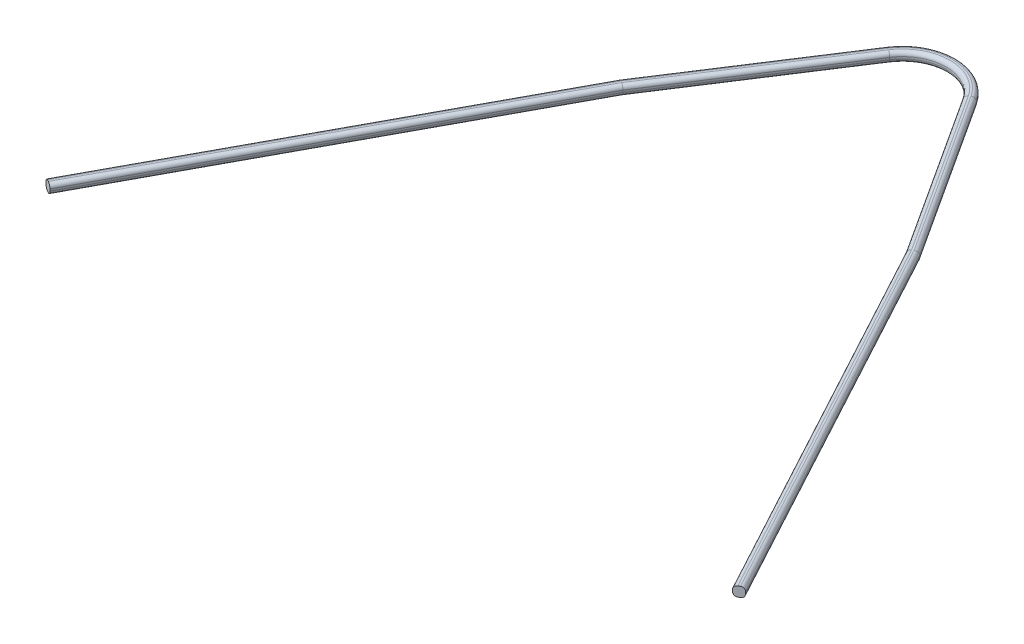
ISO-10303-21;
HEADER;
FILE_DESCRIPTION(('STEP AP214'),'2;1');
FILE_NAME('part.step','',(''),(''),'','','');
FILE_SCHEMA(('AUTOMOTIVE_DESIGN { 1 0 10303 214 1 1 1 1 }'));
ENDSEC;
DATA;
#1=APPLICATION_CONTEXT('core data for automotive mechanical design processes');
#2=APPLICATION_PROTOCOL_DEFINITION('international standard','automotive_design',2000,#1);
#3=PRODUCT_CONTEXT('',#1,'mechanical');
#4=PRODUCT('Part','Part','',(#3));
#5=PRODUCT_RELATED_PRODUCT_CATEGORY('part','',(#4));
#6=PRODUCT_DEFINITION_FORMATION('','',#4);
#7=PRODUCT_DEFINITION_CONTEXT('part definition',#1,'design');
#8=PRODUCT_DEFINITION('design','',#6,#7);
#9=PRODUCT_DEFINITION_SHAPE('','',#8);
#10=(LENGTH_UNIT() NAMED_UNIT(*) SI_UNIT(.MILLI.,.METRE.));
#11=(NAMED_UNIT(*) PLANE_ANGLE_UNIT() SI_UNIT($,.RADIAN.));
#12=(NAMED_UNIT(*) SI_UNIT($,.STERADIAN.) SOLID_ANGLE_UNIT());
#13=UNCERTAINTY_MEASURE_WITH_UNIT(LENGTH_MEASURE(1.E-05),#10,'distance_accuracy_value','');
#14=(GEOMETRIC_REPRESENTATION_CONTEXT(3) GLOBAL_UNCERTAINTY_ASSIGNED_CONTEXT((#13)) GLOBAL_UNIT_ASSIGNED_CONTEXT((#10,
#11,#12)) REPRESENTATION_CONTEXT('',''));
#15=CARTESIAN_POINT('',(0.,0.,0.));
#16=DIRECTION('',(0.,0.,1.));
#17=DIRECTION('',(1.,0.,0.));
#18=AXIS2_PLACEMENT_3D('',#15,#16,#17);
#19=CARTESIAN_POINT('',(-30.9052646215487,-1.,-33.9334810084748));
#20=DIRECTION('',(-0.879910803740285,0.,-0.475138903333673));
#21=DIRECTION('',(-0.475138903333673,0.,0.879910803740285));
#22=AXIS2_PLACEMENT_3D('',#19,#20,#21);
#23=PLANE('',#22);
#24=DIRECTION('',(0.,1.,0.));
#25=VECTOR('',#24,1.);
#26=CARTESIAN_POINT('',(-30.886104128777,-1.,-33.9689643681335));
#27=LINE('',#26,#25);
#28=CARTESIAN_POINT('',(-30.886104128777,-0.2,-33.9689643681335));
#29=VERTEX_POINT('',#28);
#30=CARTESIAN_POINT('',(-30.886104128777,0.2,-33.9689643681335));
#31=VERTEX_POINT('',#30);
#32=EDGE_CURVE('E340',#29,#31,#27,.T.);
#33=ORIENTED_EDGE('',*,*,#32,.F.);
#34=DIRECTION('',(-0.475138903333673,0.,0.879910803740285));
#35=VECTOR('',#34,1.);
#36=CARTESIAN_POINT('',(-72.303144154312,-0.2,42.7313452081154));
#37=LINE('',#36,#35);
#38=CARTESIAN_POINT('',(-72.303144154312,-0.2,42.7313452081154));
#39=VERTEX_POINT('',#38);
#40=EDGE_CURVE('E250',#29,#39,#37,.T.);
#41=ORIENTED_EDGE('',*,*,#40,.T.);
#42=DIRECTION('',(0.,1.,0.));
#43=VECTOR('',#42,1.);
#44=CARTESIAN_POINT('',(-72.303144154312,-1.,42.7313452081154));
#45=LINE('',#44,#43);
#46=CARTESIAN_POINT('',(-72.303144154312,0.2,42.7313452081154));
#47=VERTEX_POINT('',#46);
#48=EDGE_CURVE('E217',#39,#47,#45,.T.);
#49=ORIENTED_EDGE('',*,*,#48,.T.);
#50=DIRECTION('',(-0.475138903333673,0.,0.879910803740285));
#51=VECTOR('',#50,1.);
#52=CARTESIAN_POINT('',(-30.9052646215487,0.2,-33.9334810084748));
#53=LINE('',#52,#51);
#54=EDGE_CURVE('E248',#47,#31,#53,.F.);
#55=ORIENTED_EDGE('',*,*,#54,.T.);
#56=EDGE_LOOP('',(#33,#41,#49,#55));
#57=FACE_BOUND('',#56,.T.);
#58=ADVANCED_FACE('F34',(#57),#23,.T.);
#59=CARTESIAN_POINT('',(-9.2267435760683,-1.,-67.3381283920227));
#60=DIRECTION('',(-0.838794870551663,0.,-0.544447577950549));
#61=DIRECTION('',(-0.544447577950549,0.,0.838794870551663));
#62=AXIS2_PLACEMENT_3D('',#59,#60,#61);
#63=PLANE('',#62);
#64=DIRECTION('',(0.,1.,0.));
#65=VECTOR('',#64,1.);
#66=CARTESIAN_POINT('',(-9.2267435760683,-1.,-67.3381283920227));
#67=LINE('',#66,#65);
#68=CARTESIAN_POINT('',(-9.2267435760683,-0.2,-67.3381283920227));
#69=VERTEX_POINT('',#68);
#70=CARTESIAN_POINT('',(-9.2267435760683,0.2,-67.3381283920227));
#71=VERTEX_POINT('',#70);
#72=EDGE_CURVE('E473',#69,#71,#67,.T.);
#73=ORIENTED_EDGE('',*,*,#72,.F.);
#74=DIRECTION('',(-0.544447577950549,0.,0.838794870551663));
#75=VECTOR('',#74,1.);
#76=CARTESIAN_POINT('',(-30.886104128777,-0.2,-33.9689643681335));
#77=LINE('',#76,#75);
#78=EDGE_CURVE('E388',#69,#29,#77,.T.);
#79=ORIENTED_EDGE('',*,*,#78,.T.);
#80=ORIENTED_EDGE('',*,*,#32,.T.);
#81=DIRECTION('',(-0.544447577950549,0.,0.838794870551663));
#82=VECTOR('',#81,1.);
#83=CARTESIAN_POINT('',(-9.2267435760683,0.2,-67.3381283920227));
#84=LINE('',#83,#82);
#85=EDGE_CURVE('E386',#31,#71,#84,.F.);
#86=ORIENTED_EDGE('',*,*,#85,.T.);
#87=EDGE_LOOP('',(#73,#79,#80,#86));
#88=FACE_BOUND('',#87,.T.);
#89=ADVANCED_FACE('F497',(#88),#63,.T.);
#90=CARTESIAN_POINT('',(0.,-1.,-61.3492050345666));
#91=DIRECTION('',(0.,1.,0.));
#92=DIRECTION('',(0.,0.,1.));
#93=AXIS2_PLACEMENT_3D('',#90,#91,#92);
#94=CYLINDRICAL_SURFACE('',#93,11.);
#95=DIRECTION('',(0.,1.,0.));
#96=VECTOR('',#95,1.);
#97=CARTESIAN_POINT('',(9.22674357606829,-1.,-67.3381283920227));
#98=LINE('',#97,#96);
#99=CARTESIAN_POINT('',(9.22674357606829,-0.2,-67.3381283920227));
#100=VERTEX_POINT('',#99);
#101=CARTESIAN_POINT('',(9.22674357606829,0.2,-67.3381283920227));
#102=VERTEX_POINT('',#101);
#103=EDGE_CURVE('E317',#100,#102,#98,.T.);
#104=ORIENTED_EDGE('',*,*,#103,.F.);
#105=CARTESIAN_POINT('',(0.,-0.2,-61.3492050345666));
#106=DIRECTION('',(0.,1.,0.));
#107=DIRECTION('',(0.,0.,1.));
#108=AXIS2_PLACEMENT_3D('',#105,#106,#107);
#109=CIRCLE('',#108,11.);
#110=EDGE_CURVE('E393',#100,#69,#109,.T.);
#111=ORIENTED_EDGE('',*,*,#110,.T.);
#112=ORIENTED_EDGE('',*,*,#72,.T.);
#113=CARTESIAN_POINT('',(0.,0.2,-61.3492050345666));
#114=DIRECTION('',(0.,1.,0.));
#115=DIRECTION('',(0.,0.,1.));
#116=AXIS2_PLACEMENT_3D('',#113,#114,#115);
#117=CIRCLE('',#116,11.);
#118=EDGE_CURVE('E391',#71,#102,#117,.F.);
#119=ORIENTED_EDGE('',*,*,#118,.T.);
#120=EDGE_LOOP('',(#104,#111,#112,#119));
#121=FACE_BOUND('',#120,.T.);
#122=ADVANCED_FACE('F480',(#121),#94,.T.);
#123=CARTESIAN_POINT('',(9.22674357606829,-1.,-67.3381283920227));
#124=DIRECTION('',(0.838794870551663,0.,-0.544447577950549));
#125=DIRECTION('',(-0.544447577950549,0.,-0.838794870551663));
#126=AXIS2_PLACEMENT_3D('',#123,#124,#125);
#127=PLANE('',#126);
#128=DIRECTION('',(0.,1.,0.));
#129=VECTOR('',#128,1.);
#130=CARTESIAN_POINT('',(30.8861041287769,-1.,-33.9689643681335));
#131=LINE('',#130,#129);
#132=CARTESIAN_POINT('',(30.8861041287769,-0.2,-33.9689643681335));
#133=VERTEX_POINT('',#132);
#134=CARTESIAN_POINT('',(30.8861041287769,0.2,-33.9689643681335));
#135=VERTEX_POINT('',#134);
#136=EDGE_CURVE('E312',#133,#135,#131,.T.);
#137=ORIENTED_EDGE('',*,*,#136,.F.);
#138=DIRECTION('',(-0.544447577950549,0.,-0.838794870551663));
#139=VECTOR('',#138,1.);
#140=CARTESIAN_POINT('',(9.22674357606829,-0.2,-67.3381283920227));
#141=LINE('',#140,#139);
#142=EDGE_CURVE('E11',#133,#100,#141,.T.);
#143=ORIENTED_EDGE('',*,*,#142,.T.);
#144=ORIENTED_EDGE('',*,*,#103,.T.);
#145=DIRECTION('',(-0.544447577950549,0.,-0.838794870551663));
#146=VECTOR('',#145,1.);
#147=CARTESIAN_POINT('',(9.22674357606829,0.2,-67.3381283920227));
#148=LINE('',#147,#146);
#149=EDGE_CURVE('E43',#102,#135,#148,.F.);
#150=ORIENTED_EDGE('',*,*,#149,.T.);
#151=EDGE_LOOP('',(#137,#143,#144,#150));
#152=FACE_BOUND('',#151,.T.);
#153=ADVANCED_FACE('F476',(#152),#127,.T.);
#154=CARTESIAN_POINT('',(30.9052646215487,-1.,-33.9334810084748));
#155=DIRECTION('',(0.879910803740285,0.,-0.475138903333673));
#156=DIRECTION('',(-0.475138903333673,0.,-0.879910803740285));
#157=AXIS2_PLACEMENT_3D('',#154,#155,#156);
#158=PLANE('',#157);
#159=ORIENTED_EDGE('',*,*,#136,.T.);
#160=DIRECTION('',(-0.475138903333673,0.,-0.879910803740285));
#161=VECTOR('',#160,1.);
#162=CARTESIAN_POINT('',(30.9052646215487,0.2,-33.9334810084748));
#163=LINE('',#162,#161);
#164=CARTESIAN_POINT('',(72.9212176669368,0.2,43.8759569362826));
#165=VERTEX_POINT('',#164);
#166=EDGE_CURVE('E253',#135,#165,#163,.F.);
#167=ORIENTED_EDGE('',*,*,#166,.T.);
#168=DIRECTION('',(0.,1.,0.));
#169=VECTOR('',#168,1.);
#170=CARTESIAN_POINT('',(72.9212176669368,-1.,43.8759569362826));
#171=LINE('',#170,#169);
#172=CARTESIAN_POINT('',(72.9212176669368,-0.2,43.8759569362826));
#173=VERTEX_POINT('',#172);
#174=EDGE_CURVE('E311',#173,#165,#171,.T.);
#175=ORIENTED_EDGE('',*,*,#174,.F.);
#176=DIRECTION('',(-0.475138903333673,0.,-0.879910803740285));
#177=VECTOR('',#176,1.);
#178=CARTESIAN_POINT('',(30.8861041287769,-0.2,-33.9689643681335));
#179=LINE('',#178,#177);
#180=EDGE_CURVE('E57',#173,#133,#179,.T.);
#181=ORIENTED_EDGE('',*,*,#180,.T.);
#182=EDGE_LOOP('',(#159,#167,#175,#181));
#183=FACE_BOUND('',#182,.T.);
#184=ADVANCED_FACE('F310',(#183),#158,.T.);
#185=CARTESIAN_POINT('',(72.9212176669368,-1.,43.8759569362826));
#186=DIRECTION('',(-0.475138903333674,0.,-0.879910803740285));
#187=DIRECTION('',(-0.879910803740285,0.,0.475138903333674));
#188=AXIS2_PLACEMENT_3D('',#185,#186,#187);
#189=PLANE('',#188);
#190=DIRECTION('',(0.,1.,0.));
#191=VECTOR('',#190,1.);
#192=CARTESIAN_POINT('',(71.1613960594562,-1.,44.82623474295));
#193=LINE('',#192,#191);
#194=CARTESIAN_POINT('',(71.1613960594562,-0.2,44.82623474295));
#195=VERTEX_POINT('',#194);
#196=CARTESIAN_POINT('',(71.1613960594562,0.2,44.82623474295));
#197=VERTEX_POINT('',#196);
#198=EDGE_CURVE('E315',#195,#197,#193,.T.);
#199=ORIENTED_EDGE('',*,*,#198,.F.);
#200=CARTESIAN_POINT('',(71.8653247024484,-0.2,44.446123620283));
#201=DIRECTION('',(-0.475138903333674,0.,-0.879910803740285));
#202=DIRECTION('',(-0.879910803740285,0.,0.475138903333674));
#203=AXIS2_PLACEMENT_3D('',#200,#201,#202);
#204=CIRCLE('',#203,0.8);
#205=CARTESIAN_POINT('',(71.8653247024484,-1.,44.446123620283));
#206=VERTEX_POINT('',#205);
#207=EDGE_CURVE('E216',#195,#206,#204,.F.);
#208=ORIENTED_EDGE('',*,*,#207,.T.);
#209=DIRECTION('',(-0.879910803740285,0.,0.475138903333674));
#210=VECTOR('',#209,1.);
#211=CARTESIAN_POINT('',(72.9212176669368,-1.,43.8759569362826));
#212=LINE('',#211,#210);
#213=CARTESIAN_POINT('',(72.2172890239445,-1.,44.2560680589496));
#214=VERTEX_POINT('',#213);
#215=EDGE_CURVE('E200',#214,#206,#212,.T.);
#216=ORIENTED_EDGE('',*,*,#215,.F.);
#217=CARTESIAN_POINT('',(72.2172890239446,-0.2,44.2560680589496));
#218=DIRECTION('',(-0.475138903333674,0.,-0.879910803740285));
#219=DIRECTION('',(-0.879910803740285,0.,0.475138903333674));
#220=AXIS2_PLACEMENT_3D('',#217,#218,#219);
#221=CIRCLE('',#220,0.8);
#222=EDGE_CURVE('E214',#214,#173,#221,.F.);
#223=ORIENTED_EDGE('',*,*,#222,.T.);
#224=ORIENTED_EDGE('',*,*,#174,.T.);
#225=CARTESIAN_POINT('',(72.2172890239445,0.2,44.2560680589496));
#226=DIRECTION('',(-0.475138903333674,0.,-0.879910803740285));
#227=DIRECTION('',(-0.879910803740285,0.,0.475138903333674));
#228=AXIS2_PLACEMENT_3D('',#225,#226,#227);
#229=CIRCLE('',#228,0.8);
#230=CARTESIAN_POINT('',(72.2172890239445,1.,44.2560680589496));
#231=VERTEX_POINT('',#230);
#232=EDGE_CURVE('E221',#165,#231,#229,.F.);
#233=ORIENTED_EDGE('',*,*,#232,.T.);
#234=DIRECTION('',(-0.879910803740285,0.,0.475138903333674));
#235=VECTOR('',#234,1.);
#236=CARTESIAN_POINT('',(72.9212176669368,1.,43.8759569362826));
#237=LINE('',#236,#235);
#238=CARTESIAN_POINT('',(71.8653247024484,1.,44.446123620283));
#239=VERTEX_POINT('',#238);
#240=EDGE_CURVE('E465',#231,#239,#237,.T.);
#241=ORIENTED_EDGE('',*,*,#240,.T.);
#242=CARTESIAN_POINT('',(71.8653247024484,0.2,44.446123620283));
#243=DIRECTION('',(-0.475138903333674,0.,-0.879910803740285));
#244=DIRECTION('',(-0.879910803740285,0.,0.475138903333674));
#245=AXIS2_PLACEMENT_3D('',#242,#243,#244);
#246=CIRCLE('',#245,0.8);
#247=EDGE_CURVE('E224',#239,#197,#246,.F.);
#248=ORIENTED_EDGE('',*,*,#247,.T.);
#249=EDGE_LOOP('',(#199,#208,#216,#223,#224,#233,#241,#248));
#250=FACE_BOUND('',#249,.T.);
#251=ADVANCED_FACE('F212',(#250),#189,.F.);
#252=CARTESIAN_POINT('',(29.1454430140681,-1.,-32.9832032018075));
#253=DIRECTION('',(0.879910803740285,0.,-0.475138903333673));
#254=DIRECTION('',(-0.475138903333673,0.,-0.879910803740285));
#255=AXIS2_PLACEMENT_3D('',#252,#253,#254);
#256=PLANE('',#255);
#257=DIRECTION('',(0.,1.,0.));
#258=VECTOR('',#257,1.);
#259=CARTESIAN_POINT('',(29.1646035068398,-1.,-32.9477198421487));
#260=LINE('',#259,#258);
#261=CARTESIAN_POINT('',(29.1646035068398,-0.2,-32.9477198421487));
#262=VERTEX_POINT('',#261);
#263=CARTESIAN_POINT('',(29.1646035068398,0.2,-32.9477198421487));
#264=VERTEX_POINT('',#263);
#265=EDGE_CURVE('E320',#262,#264,#260,.T.);
#266=ORIENTED_EDGE('',*,*,#265,.F.);
#267=DIRECTION('',(-0.475138903333673,0.,-0.879910803740285));
#268=VECTOR('',#267,1.);
#269=CARTESIAN_POINT('',(29.1454430140681,-0.2,-32.9832032018075));
#270=LINE('',#269,#268);
#271=EDGE_CURVE('E222',#262,#195,#270,.F.);
#272=ORIENTED_EDGE('',*,*,#271,.T.);
#273=ORIENTED_EDGE('',*,*,#198,.T.);
#274=DIRECTION('',(-0.475138903333673,0.,-0.879910803740285));
#275=VECTOR('',#274,1.);
#276=CARTESIAN_POINT('',(29.1646035068398,0.2,-32.9477198421487));
#277=LINE('',#276,#275);
#278=EDGE_CURVE('E226',#197,#264,#277,.T.);
#279=ORIENTED_EDGE('',*,*,#278,.T.);
#280=EDGE_LOOP('',(#266,#272,#273,#279));
#281=FACE_BOUND('',#280,.T.);
#282=ADVANCED_FACE('F397',(#281),#256,.F.);
#283=CARTESIAN_POINT('',(7.54915383496496,-1.,-66.2492332361216));
#284=DIRECTION('',(0.838794870551663,0.,-0.544447577950549));
#285=DIRECTION('',(-0.544447577950549,0.,-0.838794870551663));
#286=AXIS2_PLACEMENT_3D('',#283,#284,#285);
#287=PLANE('',#286);
#288=DIRECTION('',(0.,1.,0.));
#289=VECTOR('',#288,1.);
#290=CARTESIAN_POINT('',(7.54915383496497,-1.,-66.2492332361216));
#291=LINE('',#290,#289);
#292=CARTESIAN_POINT('',(7.54915383496497,-0.2,-66.2492332361216));
#293=VERTEX_POINT('',#292);
#294=CARTESIAN_POINT('',(7.54915383496497,0.2,-66.2492332361216));
#295=VERTEX_POINT('',#294);
#296=EDGE_CURVE('E326',#293,#295,#291,.T.);
#297=ORIENTED_EDGE('',*,*,#296,.F.);
#298=DIRECTION('',(-0.544447577950549,0.,-0.838794870551663));
#299=VECTOR('',#298,1.);
#300=CARTESIAN_POINT('',(7.54915383496496,-0.2,-66.2492332361216));
#301=LINE('',#300,#299);
#302=EDGE_CURVE('E361',#293,#262,#301,.F.);
#303=ORIENTED_EDGE('',*,*,#302,.T.);
#304=ORIENTED_EDGE('',*,*,#265,.T.);
#305=DIRECTION('',(-0.544447577950549,0.,-0.838794870551663));
#306=VECTOR('',#305,1.);
#307=CARTESIAN_POINT('',(7.54915383496496,0.2,-66.2492332361216));
#308=LINE('',#307,#306);
#309=EDGE_CURVE('E358',#264,#295,#308,.T.);
#310=ORIENTED_EDGE('',*,*,#309,.T.);
#311=EDGE_LOOP('',(#297,#303,#304,#310));
#312=FACE_BOUND('',#311,.T.);
#313=ADVANCED_FACE('F404',(#312),#287,.F.);
#314=CARTESIAN_POINT('',(0.,-1.,-61.3492050345666));
#315=DIRECTION('',(0.,1.,0.));
#316=DIRECTION('',(0.,0.,1.));
#317=AXIS2_PLACEMENT_3D('',#314,#315,#316);
#318=CYLINDRICAL_SURFACE('',#317,9.00000000000001);
#319=DIRECTION('',(0.,1.,0.));
#320=VECTOR('',#319,1.);
#321=CARTESIAN_POINT('',(-7.54915383496498,-1.,-66.2492332361216));
#322=LINE('',#321,#320);
#323=CARTESIAN_POINT('',(-7.54915383496498,-0.2,-66.2492332361216));
#324=VERTEX_POINT('',#323);
#325=CARTESIAN_POINT('',(-7.54915383496498,0.2,-66.2492332361216));
#326=VERTEX_POINT('',#325);
#327=EDGE_CURVE('E329',#324,#326,#322,.T.);
#328=ORIENTED_EDGE('',*,*,#327,.F.);
#329=CARTESIAN_POINT('',(0.,-0.2,-61.3492050345666));
#330=DIRECTION('',(0.,1.,0.));
#331=DIRECTION('',(0.,0.,1.));
#332=AXIS2_PLACEMENT_3D('',#329,#330,#331);
#333=CIRCLE('',#332,9.00000000000001);
#334=EDGE_CURVE('E365',#324,#293,#333,.F.);
#335=ORIENTED_EDGE('',*,*,#334,.T.);
#336=ORIENTED_EDGE('',*,*,#296,.T.);
#337=CARTESIAN_POINT('',(0.,0.2,-61.3492050345666));
#338=DIRECTION('',(0.,1.,0.));
#339=DIRECTION('',(0.,0.,1.));
#340=AXIS2_PLACEMENT_3D('',#337,#338,#339);
#341=CIRCLE('',#340,9.00000000000001);
#342=EDGE_CURVE('E363',#295,#326,#341,.T.);
#343=ORIENTED_EDGE('',*,*,#342,.T.);
#344=EDGE_LOOP('',(#328,#335,#336,#343));
#345=FACE_BOUND('',#344,.T.);
#346=ADVANCED_FACE('F420',(#345),#318,.F.);
#347=CARTESIAN_POINT('',(-7.54915383496498,-1.,-66.2492332361216));
#348=DIRECTION('',(-0.838794870551663,0.,-0.544447577950549));
#349=DIRECTION('',(-0.544447577950549,0.,0.838794870551663));
#350=AXIS2_PLACEMENT_3D('',#347,#348,#349);
#351=PLANE('',#350);
#352=DIRECTION('',(0.,1.,0.));
#353=VECTOR('',#352,1.);
#354=CARTESIAN_POINT('',(-29.1646035068398,-1.,-32.9477198421487));
#355=LINE('',#354,#353);
#356=CARTESIAN_POINT('',(-29.1646035068398,-0.2,-32.9477198421487));
#357=VERTEX_POINT('',#356);
#358=CARTESIAN_POINT('',(-29.1646035068398,0.2,-32.9477198421487));
#359=VERTEX_POINT('',#358);
#360=EDGE_CURVE('E332',#357,#359,#355,.T.);
#361=ORIENTED_EDGE('',*,*,#360,.F.);
#362=DIRECTION('',(-0.544447577950549,0.,0.838794870551663));
#363=VECTOR('',#362,1.);
#364=CARTESIAN_POINT('',(-7.54915383496498,-0.2,-66.2492332361216));
#365=LINE('',#364,#363);
#366=EDGE_CURVE('E246',#357,#324,#365,.F.);
#367=ORIENTED_EDGE('',*,*,#366,.T.);
#368=ORIENTED_EDGE('',*,*,#327,.T.);
#369=DIRECTION('',(-0.544447577950549,0.,0.838794870551663));
#370=VECTOR('',#369,1.);
#371=CARTESIAN_POINT('',(-29.1646035068398,0.2,-32.9477198421487));
#372=LINE('',#371,#370);
#373=EDGE_CURVE('E244',#326,#359,#372,.T.);
#374=ORIENTED_EDGE('',*,*,#373,.T.);
#375=EDGE_LOOP('',(#361,#367,#368,#374));
#376=FACE_BOUND('',#375,.T.);
#377=ADVANCED_FACE('F425',(#376),#351,.F.);
#378=CARTESIAN_POINT('',(-29.1454430140681,-1.,-32.9832032018075));
#379=DIRECTION('',(-0.879910803740285,0.,-0.475138903333673));
#380=DIRECTION('',(-0.475138903333673,0.,0.879910803740285));
#381=AXIS2_PLACEMENT_3D('',#378,#379,#380);
#382=PLANE('',#381);
#383=DIRECTION('',(0.,1.,0.));
#384=VECTOR('',#383,1.);
#385=CARTESIAN_POINT('',(-70.5433225468314,-1.,43.6816230147827));
#386=LINE('',#385,#384);
#387=CARTESIAN_POINT('',(-70.5433225468314,-0.2,43.6816230147827));
#388=VERTEX_POINT('',#387);
#389=CARTESIAN_POINT('',(-70.5433225468314,0.2,43.6816230147827));
#390=VERTEX_POINT('',#389);
#391=EDGE_CURVE('E335',#388,#390,#386,.T.);
#392=ORIENTED_EDGE('',*,*,#391,.F.);
#393=DIRECTION('',(-0.475138903333673,0.,0.879910803740285));
#394=VECTOR('',#393,1.);
#395=CARTESIAN_POINT('',(-29.1454430140681,-0.2,-32.9832032018075));
#396=LINE('',#395,#394);
#397=EDGE_CURVE('E242',#388,#357,#396,.F.);
#398=ORIENTED_EDGE('',*,*,#397,.T.);
#399=ORIENTED_EDGE('',*,*,#360,.T.);
#400=DIRECTION('',(-0.475138903333673,0.,0.879910803740285));
#401=VECTOR('',#400,1.);
#402=CARTESIAN_POINT('',(-70.5433225468314,0.2,43.6816230147828));
#403=LINE('',#402,#401);
#404=EDGE_CURVE('E240',#359,#390,#403,.T.);
#405=ORIENTED_EDGE('',*,*,#404,.T.);
#406=EDGE_LOOP('',(#392,#398,#399,#405));
#407=FACE_BOUND('',#406,.T.);
#408=ADVANCED_FACE('F438',(#407),#382,.F.);
#409=CARTESIAN_POINT('',(-70.5433225468314,-1.,43.6816230147827));
#410=DIRECTION('',(0.475138903333671,0.,-0.879910803740286));
#411=DIRECTION('',(-0.879910803740286,0.,-0.475138903333671));
#412=AXIS2_PLACEMENT_3D('',#409,#410,#411);
#413=PLANE('',#412);
#414=DIRECTION('',(-0.879910803740286,0.,-0.475138903333671));
#415=VECTOR('',#414,1.);
#416=CARTESIAN_POINT('',(-70.5433225468314,-1.,43.6816230147827));
#417=LINE('',#416,#415);
#418=CARTESIAN_POINT('',(-71.2472511898237,-1.,43.3015118921158));
#419=VERTEX_POINT('',#418);
#420=CARTESIAN_POINT('',(-71.5992155113198,-1.,43.1114563307823));
#421=VERTEX_POINT('',#420);
#422=EDGE_CURVE('E218',#419,#421,#417,.T.);
#423=ORIENTED_EDGE('',*,*,#422,.F.);
#424=CARTESIAN_POINT('',(-71.2472511898237,-0.2,43.3015118921158));
#425=DIRECTION('',(0.475138903333671,0.,-0.879910803740286));
#426=DIRECTION('',(-0.879910803740286,0.,-0.475138903333671));
#427=AXIS2_PLACEMENT_3D('',#424,#425,#426);
#428=CIRCLE('',#427,0.8);
#429=EDGE_CURVE('E238',#419,#388,#428,.F.);
#430=ORIENTED_EDGE('',*,*,#429,.T.);
#431=ORIENTED_EDGE('',*,*,#391,.T.);
#432=CARTESIAN_POINT('',(-71.2472511898236,0.2,43.3015118921158));
#433=DIRECTION('',(0.475138903333671,0.,-0.879910803740286));
#434=DIRECTION('',(-0.879910803740286,0.,-0.475138903333671));
#435=AXIS2_PLACEMENT_3D('',#432,#433,#434);
#436=CIRCLE('',#435,0.8);
#437=CARTESIAN_POINT('',(-71.2472511898237,1.,43.3015118921158));
#438=VERTEX_POINT('',#437);
#439=EDGE_CURVE('E236',#390,#438,#436,.F.);
#440=ORIENTED_EDGE('',*,*,#439,.T.);
#441=DIRECTION('',(-0.879910803740286,0.,-0.475138903333671));
#442=VECTOR('',#441,1.);
#443=CARTESIAN_POINT('',(-70.5433225468314,1.,43.6816230147827));
#444=LINE('',#443,#442);
#445=CARTESIAN_POINT('',(-71.5992155113198,1.,43.1114563307823));
#446=VERTEX_POINT('',#445);
#447=EDGE_CURVE('E268',#438,#446,#444,.T.);
#448=ORIENTED_EDGE('',*,*,#447,.T.);
#449=CARTESIAN_POINT('',(-71.5992155113197,0.2,43.1114563307823));
#450=DIRECTION('',(0.475138903333671,0.,-0.879910803740286));
#451=DIRECTION('',(-0.879910803740286,0.,-0.475138903333671));
#452=AXIS2_PLACEMENT_3D('',#449,#450,#451);
#453=CIRCLE('',#452,0.8);
#454=EDGE_CURVE('E232',#446,#47,#453,.F.);
#455=ORIENTED_EDGE('',*,*,#454,.T.);
#456=ORIENTED_EDGE('',*,*,#48,.F.);
#457=CARTESIAN_POINT('',(-71.5992155113198,-0.2,43.1114563307823));
#458=DIRECTION('',(0.475138903333671,0.,-0.879910803740286));
#459=DIRECTION('',(-0.879910803740286,0.,-0.475138903333671));
#460=AXIS2_PLACEMENT_3D('',#457,#458,#459);
#461=CIRCLE('',#460,0.8);
#462=EDGE_CURVE('E234',#39,#421,#461,.F.);
#463=ORIENTED_EDGE('',*,*,#462,.T.);
#464=EDGE_LOOP('',(#423,#430,#431,#440,#448,#455,#456,#463));
#465=FACE_BOUND('',#464,.T.);
#466=ADVANCED_FACE('F442',(#465),#413,.F.);
#467=CARTESIAN_POINT('',(0.,-1.,-61.3492050345666));
#468=DIRECTION('',(0.,1.,0.));
#469=DIRECTION('',(1.,0.,0.));
#470=AXIS2_PLACEMENT_3D('',#467,#468,#469);
#471=PLANE('',#470);
#472=ORIENTED_EDGE('',*,*,#215,.T.);
#473=DIRECTION('',(-0.475138903333673,0.,-0.879910803740285));
#474=VECTOR('',#473,1.);
#475=CARTESIAN_POINT('',(11.4103306215407,-1.,-67.5106158902443));
#476=LINE('',#475,#474);
#477=CARTESIAN_POINT('',(29.8532037556147,-1.,-33.3562176525426));
#478=VERTEX_POINT('',#477);
#479=EDGE_CURVE('E356',#206,#478,#476,.T.);
#480=ORIENTED_EDGE('',*,*,#479,.T.);
#481=DIRECTION('',(-0.544447577950549,0.,-0.838794870551663));
#482=VECTOR('',#481,1.);
#483=CARTESIAN_POINT('',(8.22018973140629,-1.,-66.684791298482));
#484=LINE('',#483,#482);
#485=CARTESIAN_POINT('',(8.2201897314063,-1.,-66.684791298482));
#486=VERTEX_POINT('',#485);
#487=EDGE_CURVE('E353',#478,#486,#484,.T.);
#488=ORIENTED_EDGE('',*,*,#487,.T.);
#489=CARTESIAN_POINT('',(0.,-1.,-61.3492050345666));
#490=DIRECTION('',(0.,1.,0.));
#491=DIRECTION('',(0.,0.,1.));
#492=AXIS2_PLACEMENT_3D('',#489,#490,#491);
#493=CIRCLE('',#492,9.8);
#494=CARTESIAN_POINT('',(-8.22018973140631,-1.,-66.684791298482));
#495=VERTEX_POINT('',#494);
#496=EDGE_CURVE('E351',#486,#495,#493,.T.);
#497=ORIENTED_EDGE('',*,*,#496,.T.);
#498=DIRECTION('',(-0.544447577950549,0.,0.838794870551663));
#499=VECTOR('',#498,1.);
#500=CARTESIAN_POINT('',(-8.22018973140631,-1.,-66.684791298482));
#501=LINE('',#500,#499);
#502=CARTESIAN_POINT('',(-29.8532037556147,-1.,-33.3562176525426));
#503=VERTEX_POINT('',#502);
#504=EDGE_CURVE('E347',#495,#503,#501,.T.);
#505=ORIENTED_EDGE('',*,*,#504,.T.);
#506=DIRECTION('',(-0.475138903333673,0.,0.879910803740285));
#507=VECTOR('',#506,1.);
#508=CARTESIAN_POINT('',(-11.4103306215408,-1.,-67.5106158902443));
#509=LINE('',#508,#507);
#510=EDGE_CURVE('E349',#503,#419,#509,.T.);
#511=ORIENTED_EDGE('',*,*,#510,.T.);
#512=ORIENTED_EDGE('',*,*,#422,.T.);
#513=DIRECTION('',(-0.475138903333673,0.,0.879910803740285));
#514=VECTOR('',#513,1.);
#515=CARTESIAN_POINT('',(-30.1821754857847,-1.,-33.5888532454665));
#516=LINE('',#515,#514);
#517=CARTESIAN_POINT('',(-30.1975038800021,-1.,-33.5604665577396));
#518=VERTEX_POINT('',#517);
#519=EDGE_CURVE('E345',#421,#518,#516,.F.);
#520=ORIENTED_EDGE('',*,*,#519,.T.);
#521=DIRECTION('',(-0.544447577950549,0.,0.838794870551663));
#522=VECTOR('',#521,1.);
#523=CARTESIAN_POINT('',(-8.55570767962697,-1.,-66.9025703296622));
#524=LINE('',#523,#522);
#525=CARTESIAN_POINT('',(-8.55570767962696,-1.,-66.9025703296622));
#526=VERTEX_POINT('',#525);
#527=EDGE_CURVE('E343',#518,#526,#524,.F.);
#528=ORIENTED_EDGE('',*,*,#527,.T.);
#529=CARTESIAN_POINT('',(0.,-1.,-61.3492050345666));
#530=DIRECTION('',(0.,1.,0.));
#531=DIRECTION('',(0.,0.,1.));
#532=AXIS2_PLACEMENT_3D('',#529,#530,#531);
#533=CIRCLE('',#532,10.2);
#534=CARTESIAN_POINT('',(8.55570767962696,-1.,-66.9025703296622));
#535=VERTEX_POINT('',#534);
#536=EDGE_CURVE('E208',#526,#535,#533,.F.);
#537=ORIENTED_EDGE('',*,*,#536,.T.);
#538=DIRECTION('',(-0.544447577950549,0.,-0.838794870551663));
#539=VECTOR('',#538,1.);
#540=CARTESIAN_POINT('',(30.2150682323356,-1.,-33.5334063057731));
#541=LINE('',#540,#539);
#542=CARTESIAN_POINT('',(30.1975038800021,-1.,-33.5604665577396));
#543=VERTEX_POINT('',#542);
#544=EDGE_CURVE('E203',#535,#543,#541,.F.);
#545=ORIENTED_EDGE('',*,*,#544,.T.);
#546=DIRECTION('',(-0.475138903333673,0.,-0.879910803740285));
#547=VECTOR('',#546,1.);
#548=CARTESIAN_POINT('',(72.2172890239446,-1.,44.2560680589496));
#549=LINE('',#548,#547);
#550=EDGE_CURVE('E197',#543,#214,#549,.F.);
#551=ORIENTED_EDGE('',*,*,#550,.T.);
#552=EDGE_LOOP('',(#472,#480,#488,#497,#505,#511,#512,#520,#528,#537,#545,#551));
#553=FACE_BOUND('',#552,.T.);
#554=ADVANCED_FACE('F199',(#553),#471,.F.);
#555=CARTESIAN_POINT('',(0.,1.,-61.3492050345666));
#556=DIRECTION('',(0.,1.,0.));
#557=DIRECTION('',(1.,0.,0.));
#558=AXIS2_PLACEMENT_3D('',#555,#556,#557);
#559=PLANE('',#558);
#560=DIRECTION('',(-0.544447577950549,0.,-0.838794870551663));
#561=VECTOR('',#560,1.);
#562=CARTESIAN_POINT('',(29.8356394032812,1.,-33.3832779045091));
#563=LINE('',#562,#561);
#564=CARTESIAN_POINT('',(8.2201897314063,1.,-66.684791298482));
#565=VERTEX_POINT('',#564);
#566=CARTESIAN_POINT('',(29.8532037556146,1.,-33.3562176525427));
#567=VERTEX_POINT('',#566);
#568=EDGE_CURVE('E382',#565,#567,#563,.F.);
#569=ORIENTED_EDGE('',*,*,#568,.T.);
#570=DIRECTION('',(-0.475138903333673,0.,-0.879910803740285));
#571=VECTOR('',#570,1.);
#572=CARTESIAN_POINT('',(71.8653247024484,1.,44.4461236202831));
#573=LINE('',#572,#571);
#574=EDGE_CURVE('E384',#567,#239,#573,.F.);
#575=ORIENTED_EDGE('',*,*,#574,.T.);
#576=ORIENTED_EDGE('',*,*,#240,.F.);
#577=DIRECTION('',(-0.475138903333673,0.,-0.879910803740285));
#578=VECTOR('',#577,1.);
#579=CARTESIAN_POINT('',(11.7622949430368,1.,-67.7006714515778));
#580=LINE('',#579,#578);
#581=CARTESIAN_POINT('',(30.197503880002,1.,-33.5604665577397));
#582=VERTEX_POINT('',#581);
#583=EDGE_CURVE('E309',#231,#582,#580,.T.);
#584=ORIENTED_EDGE('',*,*,#583,.T.);
#585=DIRECTION('',(-0.544447577950549,0.,-0.838794870551663));
#586=VECTOR('',#585,1.);
#587=CARTESIAN_POINT('',(8.55570767962696,1.,-66.9025703296622));
#588=LINE('',#587,#586);
#589=CARTESIAN_POINT('',(8.55570767962696,1.,-66.9025703296622));
#590=VERTEX_POINT('',#589);
#591=EDGE_CURVE('E304',#582,#590,#588,.T.);
#592=ORIENTED_EDGE('',*,*,#591,.T.);
#593=CARTESIAN_POINT('',(0.,1.,-61.3492050345666));
#594=DIRECTION('',(0.,1.,0.));
#595=DIRECTION('',(0.,0.,1.));
#596=AXIS2_PLACEMENT_3D('',#593,#594,#595);
#597=CIRCLE('',#596,10.2);
#598=CARTESIAN_POINT('',(-8.55570767962696,1.,-66.9025703296622));
#599=VERTEX_POINT('',#598);
#600=EDGE_CURVE('E369',#590,#599,#597,.T.);
#601=ORIENTED_EDGE('',*,*,#600,.T.);
#602=DIRECTION('',(-0.544447577950549,0.,0.838794870551663));
#603=VECTOR('',#602,1.);
#604=CARTESIAN_POINT('',(-8.55570767962698,1.,-66.9025703296622));
#605=LINE('',#604,#603);
#606=CARTESIAN_POINT('',(-30.197503880002,1.,-33.5604665577397));
#607=VERTEX_POINT('',#606);
#608=EDGE_CURVE('E371',#599,#607,#605,.T.);
#609=ORIENTED_EDGE('',*,*,#608,.T.);
#610=DIRECTION('',(-0.475138903333673,0.,0.879910803740285));
#611=VECTOR('',#610,1.);
#612=CARTESIAN_POINT('',(-11.7622949430369,1.,-67.7006714515778));
#613=LINE('',#612,#611);
#614=EDGE_CURVE('E374',#607,#446,#613,.T.);
#615=ORIENTED_EDGE('',*,*,#614,.T.);
#616=ORIENTED_EDGE('',*,*,#447,.F.);
#617=DIRECTION('',(-0.475138903333673,0.,0.879910803740285));
#618=VECTOR('',#617,1.);
#619=CARTESIAN_POINT('',(-29.8685321498321,1.,-33.3278309648157));
#620=LINE('',#619,#618);
#621=CARTESIAN_POINT('',(-29.8532037556147,1.,-33.3562176525426));
#622=VERTEX_POINT('',#621);
#623=EDGE_CURVE('E378',#438,#622,#620,.F.);
#624=ORIENTED_EDGE('',*,*,#623,.T.);
#625=DIRECTION('',(-0.544447577950549,0.,0.838794870551663));
#626=VECTOR('',#625,1.);
#627=CARTESIAN_POINT('',(-8.22018973140631,1.,-66.684791298482));
#628=LINE('',#627,#626);
#629=CARTESIAN_POINT('',(-8.22018973140631,1.,-66.684791298482));
#630=VERTEX_POINT('',#629);
#631=EDGE_CURVE('E376',#622,#630,#628,.F.);
#632=ORIENTED_EDGE('',*,*,#631,.T.);
#633=CARTESIAN_POINT('',(0.,1.,-61.3492050345666));
#634=DIRECTION('',(0.,1.,0.));
#635=DIRECTION('',(0.,0.,1.));
#636=AXIS2_PLACEMENT_3D('',#633,#634,#635);
#637=CIRCLE('',#636,9.8);
#638=EDGE_CURVE('E380',#630,#565,#637,.F.);
#639=ORIENTED_EDGE('',*,*,#638,.T.);
#640=EDGE_LOOP('',(#569,#575,#576,#584,#592,#601,#609,#615,#616,#624,#632,#639));
#641=FACE_BOUND('',#640,.T.);
#642=ADVANCED_FACE('F512',(#641),#559,.T.);
#643=CARTESIAN_POINT('',(-11.4103306215407,-0.2,-67.5106158902443));
#644=DIRECTION('',(-0.475138903333673,0.,0.879910803740285));
#645=DIRECTION('',(0.879910803740285,0.,0.475138903333673));
#646=AXIS2_PLACEMENT_3D('',#643,#644,#645);
#647=CYLINDRICAL_SURFACE('',#646,0.8);
#648=ORIENTED_EDGE('',*,*,#429,.F.);
#649=ORIENTED_EDGE('',*,*,#510,.F.);
#650=CARTESIAN_POINT('',(-29.8532037556148,-0.2,-33.3562176525425));
#651=DIRECTION('',(-0.510207583435289,0.,0.860051290217695));
#652=DIRECTION('',(0.860051290217695,0.,0.510207583435289));
#653=AXIS2_PLACEMENT_3D('',#650,#651,#652);
#654=ELLIPSE('',#653,0.800650213082711,0.8);
#655=EDGE_CURVE('E265',#357,#503,#654,.F.);
#656=ORIENTED_EDGE('',*,*,#655,.F.);
#657=ORIENTED_EDGE('',*,*,#397,.F.);
#658=EDGE_LOOP('',(#648,#649,#656,#657));
#659=FACE_BOUND('',#658,.T.);
#660=ADVANCED_FACE('F449',(#659),#647,.T.);
#661=CARTESIAN_POINT('',(-8.22018973140631,-0.2,-66.684791298482));
#662=DIRECTION('',(-0.544447577950549,0.,0.838794870551663));
#663=DIRECTION('',(0.838794870551663,0.,0.544447577950549));
#664=AXIS2_PLACEMENT_3D('',#661,#662,#663);
#665=CYLINDRICAL_SURFACE('',#664,0.8);
#666=ORIENTED_EDGE('',*,*,#655,.T.);
#667=ORIENTED_EDGE('',*,*,#504,.F.);
#668=CARTESIAN_POINT('',(-8.22018973140631,-0.2,-66.684791298482));
#669=DIRECTION('',(0.544447577950548,0.,-0.838794870551663));
#670=DIRECTION('',(-0.838794870551663,0.,-0.544447577950548));
#671=AXIS2_PLACEMENT_3D('',#668,#669,#670);
#672=CIRCLE('',#671,0.8);
#673=EDGE_CURVE('E262',#324,#495,#672,.T.);
#674=ORIENTED_EDGE('',*,*,#673,.F.);
#675=ORIENTED_EDGE('',*,*,#366,.F.);
#676=EDGE_LOOP('',(#666,#667,#674,#675));
#677=FACE_BOUND('',#676,.T.);
#678=ADVANCED_FACE('F453',(#677),#665,.T.);
#679=CARTESIAN_POINT('',(11.4103306215407,-0.2,-67.5106158902443));
#680=DIRECTION('',(-0.475138903333673,0.,-0.879910803740285));
#681=DIRECTION('',(-0.879910803740285,0.,0.475138903333673));
#682=AXIS2_PLACEMENT_3D('',#679,#680,#681);
#683=CYLINDRICAL_SURFACE('',#682,0.8);
#684=ORIENTED_EDGE('',*,*,#207,.F.);
#685=ORIENTED_EDGE('',*,*,#271,.F.);
#686=CARTESIAN_POINT('',(29.8532037556147,-0.2,-33.3562176525426));
#687=DIRECTION('',(-0.51020758343529,0.,-0.860051290217695));
#688=DIRECTION('',(-0.860051290217694,0.,0.510207583435291));
#689=AXIS2_PLACEMENT_3D('',#686,#687,#688);
#690=ELLIPSE('',#689,0.800650213082711,0.8);
#691=EDGE_CURVE('E258',#478,#262,#690,.T.);
#692=ORIENTED_EDGE('',*,*,#691,.F.);
#693=ORIENTED_EDGE('',*,*,#479,.F.);
#694=EDGE_LOOP('',(#684,#685,#692,#693));
#695=FACE_BOUND('',#694,.T.);
#696=ADVANCED_FACE('F464',(#695),#683,.T.);
#697=CARTESIAN_POINT('',(0.,-0.2,-61.3492050345666));
#698=DIRECTION('',(0.,1.,0.));
#699=DIRECTION('',(0.,0.,1.));
#700=AXIS2_PLACEMENT_3D('',#697,#698,#699);
#701=TOROIDAL_SURFACE('',#700,9.8,0.8);
#702=ORIENTED_EDGE('',*,*,#673,.T.);
#703=ORIENTED_EDGE('',*,*,#496,.F.);
#704=CARTESIAN_POINT('',(8.2201897314063,-0.2,-66.684791298482));
#705=DIRECTION('',(0.544447577950549,0.,0.838794870551663));
#706=DIRECTION('',(0.838794870551663,0.,-0.544447577950549));
#707=AXIS2_PLACEMENT_3D('',#704,#705,#706);
#708=CIRCLE('',#707,0.8);
#709=EDGE_CURVE('E256',#293,#486,#708,.T.);
#710=ORIENTED_EDGE('',*,*,#709,.F.);
#711=ORIENTED_EDGE('',*,*,#334,.F.);
#712=EDGE_LOOP('',(#702,#703,#710,#711));
#713=FACE_BOUND('',#712,.T.);
#714=ADVANCED_FACE('F458',(#713),#701,.T.);
#715=CARTESIAN_POINT('',(8.22018973140629,-0.2,-66.684791298482));
#716=DIRECTION('',(-0.544447577950549,0.,-0.838794870551663));
#717=DIRECTION('',(-0.838794870551663,0.,0.544447577950549));
#718=AXIS2_PLACEMENT_3D('',#715,#716,#717);
#719=CYLINDRICAL_SURFACE('',#718,0.8);
#720=ORIENTED_EDGE('',*,*,#691,.T.);
#721=ORIENTED_EDGE('',*,*,#302,.F.);
#722=ORIENTED_EDGE('',*,*,#709,.T.);
#723=ORIENTED_EDGE('',*,*,#487,.F.);
#724=EDGE_LOOP('',(#720,#721,#722,#723));
#725=FACE_BOUND('',#724,.T.);
#726=ADVANCED_FACE('F460',(#725),#719,.T.);
#727=CARTESIAN_POINT('',(-29.8493716570603,0.2,-33.3633143244744));
#728=DIRECTION('',(0.475138903333673,0.,-0.879910803740285));
#729=DIRECTION('',(-0.879910803740285,0.,-0.475138903333673));
#730=AXIS2_PLACEMENT_3D('',#727,#728,#729);
#731=CYLINDRICAL_SURFACE('',#730,0.8);
#732=ORIENTED_EDGE('',*,*,#439,.F.);
#733=ORIENTED_EDGE('',*,*,#404,.F.);
#734=CARTESIAN_POINT('',(-29.8532037556143,0.2,-33.3562176525432));
#735=DIRECTION('',(0.510207583435289,0.,-0.860051290217695));
#736=DIRECTION('',(-0.860051290217695,0.,-0.510207583435289));
#737=AXIS2_PLACEMENT_3D('',#734,#735,#736);
#738=ELLIPSE('',#737,0.800650213082711,0.8);
#739=EDGE_CURVE('E259',#622,#359,#738,.T.);
#740=ORIENTED_EDGE('',*,*,#739,.F.);
#741=ORIENTED_EDGE('',*,*,#623,.F.);
#742=EDGE_LOOP('',(#732,#733,#740,#741));
#743=FACE_BOUND('',#742,.T.);
#744=ADVANCED_FACE('F435',(#743),#731,.T.);
#745=CARTESIAN_POINT('',(-8.22018973140631,0.2,-66.684791298482));
#746=DIRECTION('',(0.544447577950549,0.,-0.838794870551663));
#747=DIRECTION('',(-0.838794870551663,0.,-0.544447577950549));
#748=AXIS2_PLACEMENT_3D('',#745,#746,#747);
#749=CYLINDRICAL_SURFACE('',#748,0.8);
#750=ORIENTED_EDGE('',*,*,#739,.T.);
#751=ORIENTED_EDGE('',*,*,#373,.F.);
#752=CARTESIAN_POINT('',(-8.22018973140631,0.2,-66.684791298482));
#753=DIRECTION('',(0.544447577950548,0.,-0.838794870551663));
#754=DIRECTION('',(-0.838794870551663,0.,-0.544447577950548));
#755=AXIS2_PLACEMENT_3D('',#752,#753,#754);
#756=CIRCLE('',#755,0.8);
#757=EDGE_CURVE('E275',#630,#326,#756,.T.);
#758=ORIENTED_EDGE('',*,*,#757,.F.);
#759=ORIENTED_EDGE('',*,*,#631,.F.);
#760=EDGE_LOOP('',(#750,#751,#758,#759));
#761=FACE_BOUND('',#760,.T.);
#762=ADVANCED_FACE('F428',(#761),#749,.T.);
#763=CARTESIAN_POINT('',(29.8493716570603,0.2,-33.3633143244744));
#764=DIRECTION('',(0.475138903333673,0.,0.879910803740285));
#765=DIRECTION('',(0.879910803740285,0.,-0.475138903333673));
#766=AXIS2_PLACEMENT_3D('',#763,#764,#765);
#767=CYLINDRICAL_SURFACE('',#766,0.8);
#768=ORIENTED_EDGE('',*,*,#247,.F.);
#769=ORIENTED_EDGE('',*,*,#574,.F.);
#770=CARTESIAN_POINT('',(29.8532037556138,0.2,-33.3562176525441));
#771=DIRECTION('',(0.51020758343529,0.,0.860051290217695));
#772=DIRECTION('',(0.860051290217694,0.,-0.510207583435291));
#773=AXIS2_PLACEMENT_3D('',#770,#771,#772);
#774=ELLIPSE('',#773,0.800650213082711,0.8);
#775=EDGE_CURVE('E271',#264,#567,#774,.F.);
#776=ORIENTED_EDGE('',*,*,#775,.F.);
#777=ORIENTED_EDGE('',*,*,#278,.F.);
#778=EDGE_LOOP('',(#768,#769,#776,#777));
#779=FACE_BOUND('',#778,.T.);
#780=ADVANCED_FACE('F408',(#779),#767,.T.);
#781=CARTESIAN_POINT('',(0.,0.2,-61.3492050345666));
#782=DIRECTION('',(0.,1.,0.));
#783=DIRECTION('',(0.,0.,1.));
#784=AXIS2_PLACEMENT_3D('',#781,#782,#783);
#785=TOROIDAL_SURFACE('',#784,9.8,0.8);
#786=ORIENTED_EDGE('',*,*,#757,.T.);
#787=ORIENTED_EDGE('',*,*,#342,.F.);
#788=CARTESIAN_POINT('',(8.2201897314063,0.2,-66.684791298482));
#789=DIRECTION('',(0.544447577950549,0.,0.838794870551663));
#790=DIRECTION('',(0.838794870551663,0.,-0.544447577950549));
#791=AXIS2_PLACEMENT_3D('',#788,#789,#790);
#792=CIRCLE('',#791,0.8);
#793=EDGE_CURVE('E269',#565,#295,#792,.T.);
#794=ORIENTED_EDGE('',*,*,#793,.F.);
#795=ORIENTED_EDGE('',*,*,#638,.F.);
#796=EDGE_LOOP('',(#786,#787,#794,#795));
#797=FACE_BOUND('',#796,.T.);
#798=ADVANCED_FACE('F416',(#797),#785,.T.);
#799=CARTESIAN_POINT('',(8.22018973140629,0.2,-66.684791298482));
#800=DIRECTION('',(0.544447577950549,0.,0.838794870551663));
#801=DIRECTION('',(0.838794870551663,0.,-0.544447577950549));
#802=AXIS2_PLACEMENT_3D('',#799,#800,#801);
#803=CYLINDRICAL_SURFACE('',#802,0.8);
#804=ORIENTED_EDGE('',*,*,#775,.T.);
#805=ORIENTED_EDGE('',*,*,#568,.F.);
#806=ORIENTED_EDGE('',*,*,#793,.T.);
#807=ORIENTED_EDGE('',*,*,#309,.F.);
#808=EDGE_LOOP('',(#804,#805,#806,#807));
#809=FACE_BOUND('',#808,.T.);
#810=ADVANCED_FACE('F411',(#809),#803,.T.);
#811=CARTESIAN_POINT('',(30.2013359785564,-0.2,-33.5533698858079));
#812=DIRECTION('',(0.475138903333673,0.,0.879910803740285));
#813=DIRECTION('',(0.879910803740285,0.,-0.475138903333673));
#814=AXIS2_PLACEMENT_3D('',#811,#812,#813);
#815=CYLINDRICAL_SURFACE('',#814,0.8);
#816=ORIENTED_EDGE('',*,*,#222,.F.);
#817=ORIENTED_EDGE('',*,*,#550,.F.);
#818=CARTESIAN_POINT('',(30.1975038800017,-0.2,-33.5604665577403));
#819=DIRECTION('',(0.51020758343529,0.,0.860051290217695));
#820=DIRECTION('',(0.860051290217694,0.,-0.510207583435291));
#821=AXIS2_PLACEMENT_3D('',#818,#819,#820);
#822=ELLIPSE('',#821,0.800650213082711,0.8);
#823=EDGE_CURVE('E272',#133,#543,#822,.F.);
#824=ORIENTED_EDGE('',*,*,#823,.F.);
#825=ORIENTED_EDGE('',*,*,#180,.F.);
#826=EDGE_LOOP('',(#816,#817,#824,#825));
#827=FACE_BOUND('',#826,.T.);
#828=ADVANCED_FACE('F220',(#827),#815,.T.);
#829=CARTESIAN_POINT('',(8.55570767962696,-0.2,-66.9025703296622));
#830=DIRECTION('',(0.544447577950549,0.,0.838794870551663));
#831=DIRECTION('',(0.838794870551663,0.,-0.544447577950549));
#832=AXIS2_PLACEMENT_3D('',#829,#830,#831);
#833=CYLINDRICAL_SURFACE('',#832,0.8);
#834=ORIENTED_EDGE('',*,*,#823,.T.);
#835=ORIENTED_EDGE('',*,*,#544,.F.);
#836=CARTESIAN_POINT('',(8.55570767962696,-0.2,-66.9025703296622));
#837=DIRECTION('',(-0.544447577950549,0.,-0.838794870551663));
#838=DIRECTION('',(-0.838794870551663,0.,0.544447577950549));
#839=AXIS2_PLACEMENT_3D('',#836,#837,#838);
#840=CIRCLE('',#839,0.8);
#841=EDGE_CURVE('E285',#100,#535,#840,.T.);
#842=ORIENTED_EDGE('',*,*,#841,.F.);
#843=ORIENTED_EDGE('',*,*,#142,.F.);
#844=EDGE_LOOP('',(#834,#835,#842,#843));
#845=FACE_BOUND('',#844,.T.);
#846=ADVANCED_FACE('F484',(#845),#833,.T.);
#847=CARTESIAN_POINT('',(0.,-0.2,-61.3492050345666));
#848=DIRECTION('',(0.,1.,0.));
#849=DIRECTION('',(0.,0.,1.));
#850=AXIS2_PLACEMENT_3D('',#847,#848,#849);
#851=TOROIDAL_SURFACE('',#850,10.2,0.8);
#852=ORIENTED_EDGE('',*,*,#841,.T.);
#853=ORIENTED_EDGE('',*,*,#536,.F.);
#854=CARTESIAN_POINT('',(-8.55570767962697,-0.2,-66.9025703296622));
#855=DIRECTION('',(-0.544447577950549,0.,0.838794870551663));
#856=DIRECTION('',(0.838794870551663,0.,0.544447577950549));
#857=AXIS2_PLACEMENT_3D('',#854,#855,#856);
#858=CIRCLE('',#857,0.8);
#859=EDGE_CURVE('E282',#69,#526,#858,.T.);
#860=ORIENTED_EDGE('',*,*,#859,.F.);
#861=ORIENTED_EDGE('',*,*,#110,.F.);
#862=EDGE_LOOP('',(#852,#853,#860,#861));
#863=FACE_BOUND('',#862,.T.);
#864=ADVANCED_FACE('F488',(#863),#851,.T.);
#865=CARTESIAN_POINT('',(-30.2013359785564,-0.2,-33.5533698858079));
#866=DIRECTION('',(0.475138903333673,0.,-0.879910803740285));
#867=DIRECTION('',(-0.879910803740285,0.,-0.475138903333673));
#868=AXIS2_PLACEMENT_3D('',#865,#866,#867);
#869=CYLINDRICAL_SURFACE('',#868,0.8);
#870=ORIENTED_EDGE('',*,*,#462,.F.);
#871=ORIENTED_EDGE('',*,*,#40,.F.);
#872=CARTESIAN_POINT('',(-30.1975038800024,-0.2,-33.5604665577391));
#873=DIRECTION('',(0.510207583435289,0.,-0.860051290217695));
#874=DIRECTION('',(-0.860051290217695,0.,-0.510207583435289));
#875=AXIS2_PLACEMENT_3D('',#872,#873,#874);
#876=ELLIPSE('',#875,0.800650213082711,0.8);
#877=EDGE_CURVE('E280',#518,#29,#876,.T.);
#878=ORIENTED_EDGE('',*,*,#877,.F.);
#879=ORIENTED_EDGE('',*,*,#519,.F.);
#880=EDGE_LOOP('',(#870,#871,#878,#879));
#881=FACE_BOUND('',#880,.T.);
#882=ADVANCED_FACE('F516',(#881),#869,.T.);
#883=CARTESIAN_POINT('',(-8.55570767962697,-0.2,-66.9025703296622));
#884=DIRECTION('',(0.544447577950549,0.,-0.838794870551663));
#885=DIRECTION('',(-0.838794870551663,0.,-0.544447577950549));
#886=AXIS2_PLACEMENT_3D('',#883,#884,#885);
#887=CYLINDRICAL_SURFACE('',#886,0.8);
#888=ORIENTED_EDGE('',*,*,#859,.T.);
#889=ORIENTED_EDGE('',*,*,#527,.F.);
#890=ORIENTED_EDGE('',*,*,#877,.T.);
#891=ORIENTED_EDGE('',*,*,#78,.F.);
#892=EDGE_LOOP('',(#888,#889,#890,#891));
#893=FACE_BOUND('',#892,.T.);
#894=ADVANCED_FACE('F492',(#893),#887,.T.);
#895=CARTESIAN_POINT('',(11.7622949430368,0.2,-67.7006714515778));
#896=DIRECTION('',(-0.475138903333673,0.,-0.879910803740285));
#897=DIRECTION('',(-0.879910803740285,0.,0.475138903333673));
#898=AXIS2_PLACEMENT_3D('',#895,#896,#897);
#899=CYLINDRICAL_SURFACE('',#898,0.8);
#900=ORIENTED_EDGE('',*,*,#232,.F.);
#901=ORIENTED_EDGE('',*,*,#166,.F.);
#902=CARTESIAN_POINT('',(30.197503880002,0.2,-33.5604665577397));
#903=DIRECTION('',(-0.51020758343529,0.,-0.860051290217695));
#904=DIRECTION('',(-0.860051290217694,0.,0.510207583435291));
#905=AXIS2_PLACEMENT_3D('',#902,#903,#904);
#906=ELLIPSE('',#905,0.800650213082711,0.8);
#907=EDGE_CURVE('E38',#582,#135,#906,.T.);
#908=ORIENTED_EDGE('',*,*,#907,.F.);
#909=ORIENTED_EDGE('',*,*,#583,.F.);
#910=EDGE_LOOP('',(#900,#901,#908,#909));
#911=FACE_BOUND('',#910,.T.);
#912=ADVANCED_FACE('F36',(#911),#899,.T.);
#913=CARTESIAN_POINT('',(8.55570767962696,0.2,-66.9025703296622));
#914=DIRECTION('',(-0.544447577950549,0.,-0.838794870551663));
#915=DIRECTION('',(-0.838794870551663,0.,0.544447577950549));
#916=AXIS2_PLACEMENT_3D('',#913,#914,#915);
#917=CYLINDRICAL_SURFACE('',#916,0.8);
#918=ORIENTED_EDGE('',*,*,#907,.T.);
#919=ORIENTED_EDGE('',*,*,#149,.F.);
#920=CARTESIAN_POINT('',(8.55570767962696,0.2,-66.9025703296622));
#921=DIRECTION('',(-0.54444757795055,0.,-0.838794870551662));
#922=DIRECTION('',(-0.838794870551662,0.,0.54444757795055));
#923=AXIS2_PLACEMENT_3D('',#920,#921,#922);
#924=CIRCLE('',#923,0.8);
#925=EDGE_CURVE('E293',#590,#102,#924,.T.);
#926=ORIENTED_EDGE('',*,*,#925,.F.);
#927=ORIENTED_EDGE('',*,*,#591,.F.);
#928=EDGE_LOOP('',(#918,#919,#926,#927));
#929=FACE_BOUND('',#928,.T.);
#930=ADVANCED_FACE('F303',(#929),#917,.T.);
#931=CARTESIAN_POINT('',(0.,0.2,-61.3492050345666));
#932=DIRECTION('',(0.,1.,0.));
#933=DIRECTION('',(0.,0.,1.));
#934=AXIS2_PLACEMENT_3D('',#931,#932,#933);
#935=TOROIDAL_SURFACE('',#934,10.2,0.8);
#936=ORIENTED_EDGE('',*,*,#925,.T.);
#937=ORIENTED_EDGE('',*,*,#118,.F.);
#938=CARTESIAN_POINT('',(-8.55570767962696,0.2,-66.9025703296622));
#939=DIRECTION('',(-0.544447577950548,0.,0.838794870551663));
#940=DIRECTION('',(0.838794870551663,0.,0.544447577950548));
#941=AXIS2_PLACEMENT_3D('',#938,#939,#940);
#942=CIRCLE('',#941,0.8);
#943=EDGE_CURVE('E291',#599,#71,#942,.T.);
#944=ORIENTED_EDGE('',*,*,#943,.F.);
#945=ORIENTED_EDGE('',*,*,#600,.F.);
#946=EDGE_LOOP('',(#936,#937,#944,#945));
#947=FACE_BOUND('',#946,.T.);
#948=ADVANCED_FACE('F511',(#947),#935,.T.);
#949=CARTESIAN_POINT('',(-11.7622949430368,0.2,-67.7006714515778));
#950=DIRECTION('',(-0.475138903333673,0.,0.879910803740285));
#951=DIRECTION('',(0.879910803740285,0.,0.475138903333673));
#952=AXIS2_PLACEMENT_3D('',#949,#950,#951);
#953=CYLINDRICAL_SURFACE('',#952,0.8);
#954=ORIENTED_EDGE('',*,*,#454,.F.);
#955=ORIENTED_EDGE('',*,*,#614,.F.);
#956=CARTESIAN_POINT('',(-30.197503880002,0.2,-33.5604665577397));
#957=DIRECTION('',(-0.510207583435289,0.,0.860051290217695));
#958=DIRECTION('',(0.860051290217695,0.,0.510207583435289));
#959=AXIS2_PLACEMENT_3D('',#956,#957,#958);
#960=ELLIPSE('',#959,0.800650213082711,0.8);
#961=EDGE_CURVE('E289',#31,#607,#960,.F.);
#962=ORIENTED_EDGE('',*,*,#961,.F.);
#963=ORIENTED_EDGE('',*,*,#54,.F.);
#964=EDGE_LOOP('',(#954,#955,#962,#963));
#965=FACE_BOUND('',#964,.T.);
#966=ADVANCED_FACE('F505',(#965),#953,.T.);
#967=CARTESIAN_POINT('',(-8.55570767962697,0.2,-66.9025703296622));
#968=DIRECTION('',(-0.544447577950549,0.,0.838794870551663));
#969=DIRECTION('',(0.838794870551663,0.,0.544447577950549));
#970=AXIS2_PLACEMENT_3D('',#967,#968,#969);
#971=CYLINDRICAL_SURFACE('',#970,0.8);
#972=ORIENTED_EDGE('',*,*,#943,.T.);
#973=ORIENTED_EDGE('',*,*,#85,.F.);
#974=ORIENTED_EDGE('',*,*,#961,.T.);
#975=ORIENTED_EDGE('',*,*,#608,.F.);
#976=EDGE_LOOP('',(#972,#973,#974,#975));
#977=FACE_BOUND('',#976,.T.);
#978=ADVANCED_FACE('F509',(#977),#971,.T.);
#979=CLOSED_SHELL('',(#58,#89,#122,#153,#184,#251,#282,#313,#346,#377,#408,#466,#554,#642,#660,
#678,#696,#714,#726,#744,#762,#780,#798,#810,#828,#846,#864,#882,#894,#912,#930,#948,#966,#978));
#980=MANIFOLD_SOLID_BREP('B2',#979);
#981=ADVANCED_BREP_SHAPE_REPRESENTATION('',(#18,#980),#14);
#982=SHAPE_DEFINITION_REPRESENTATION(#9,#981);
ENDSEC;
END-ISO-10303-21;
